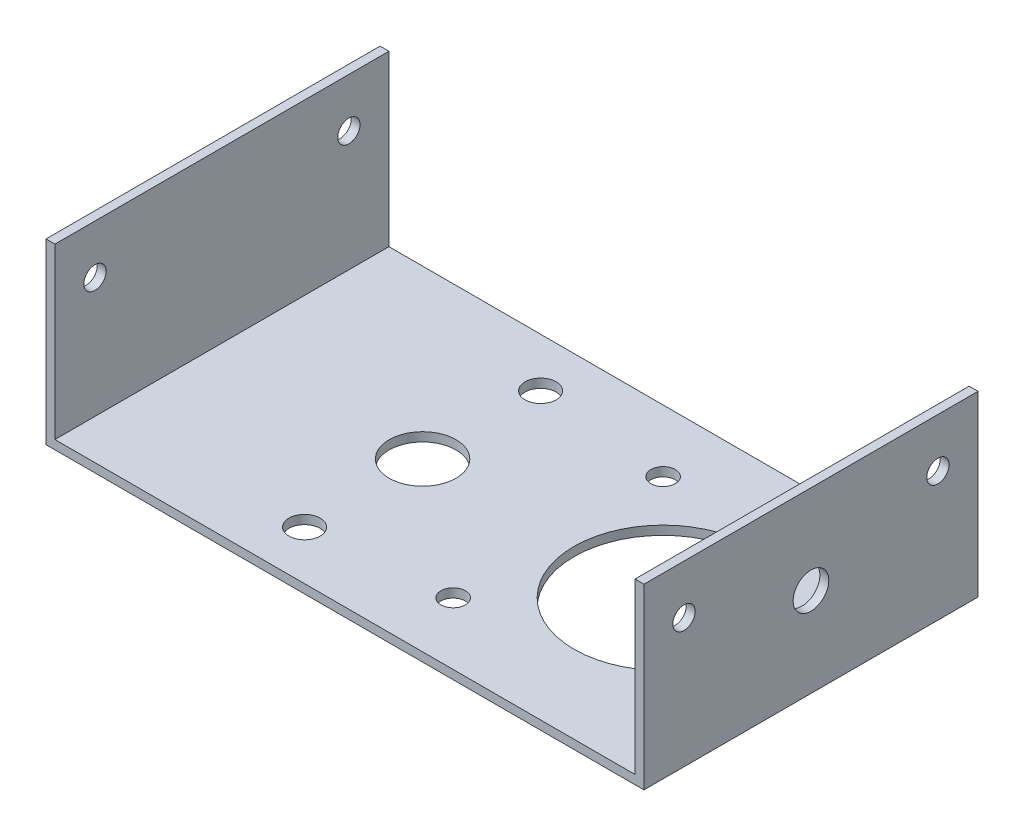
ISO-10303-21;
HEADER;
FILE_DESCRIPTION(('STEP AP214'),'2;1');
FILE_NAME('part.step','',(''),(''),'','','');
FILE_SCHEMA(('AUTOMOTIVE_DESIGN { 1 0 10303 214 1 1 1 1 }'));
ENDSEC;
DATA;
#1=APPLICATION_CONTEXT('core data for automotive mechanical design processes');
#2=APPLICATION_PROTOCOL_DEFINITION('international standard','automotive_design',2000,#1);
#3=PRODUCT_CONTEXT('',#1,'mechanical');
#4=PRODUCT('Part','Part','',(#3));
#5=PRODUCT_RELATED_PRODUCT_CATEGORY('part','',(#4));
#6=PRODUCT_DEFINITION_FORMATION('','',#4);
#7=PRODUCT_DEFINITION_CONTEXT('part definition',#1,'design');
#8=PRODUCT_DEFINITION('design','',#6,#7);
#9=PRODUCT_DEFINITION_SHAPE('','',#8);
#10=(LENGTH_UNIT() NAMED_UNIT(*) SI_UNIT(.MILLI.,.METRE.));
#11=(NAMED_UNIT(*) PLANE_ANGLE_UNIT() SI_UNIT($,.RADIAN.));
#12=(NAMED_UNIT(*) SI_UNIT($,.STERADIAN.) SOLID_ANGLE_UNIT());
#13=UNCERTAINTY_MEASURE_WITH_UNIT(LENGTH_MEASURE(1.E-05),#10,'distance_accuracy_value','');
#14=(GEOMETRIC_REPRESENTATION_CONTEXT(3) GLOBAL_UNCERTAINTY_ASSIGNED_CONTEXT((#13)) GLOBAL_UNIT_ASSIGNED_CONTEXT((#10,
#11,#12)) REPRESENTATION_CONTEXT('',''));
#15=CARTESIAN_POINT('',(0.,0.,0.));
#16=DIRECTION('',(0.,0.,1.));
#17=DIRECTION('',(1.,0.,0.));
#18=AXIS2_PLACEMENT_3D('',#15,#16,#17);
#19=CARTESIAN_POINT('',(-33.2,40.,-37.5));
#20=DIRECTION('',(0.,1.,0.));
#21=DIRECTION('',(0.,0.,1.));
#22=AXIS2_PLACEMENT_3D('',#19,#20,#21);
#23=PLANE('',#22);
#24=DIRECTION('',(1.,0.,0.));
#25=VECTOR('',#24,1.);
#26=CARTESIAN_POINT('',(-33.2,40.,37.5));
#27=LINE('',#26,#25);
#28=CARTESIAN_POINT('',(-101.05,40.,37.5));
#29=VERTEX_POINT('',#28);
#30=CARTESIAN_POINT('',(-99.05,40.,37.5));
#31=VERTEX_POINT('',#30);
#32=EDGE_CURVE('E212',#29,#31,#27,.T.);
#33=ORIENTED_EDGE('',*,*,#32,.T.);
#34=DIRECTION('',(0.,0.,1.));
#35=VECTOR('',#34,1.);
#36=CARTESIAN_POINT('',(-99.05,40.,-37.5));
#37=LINE('',#36,#35);
#38=CARTESIAN_POINT('',(-99.05,40.,-37.5));
#39=VERTEX_POINT('',#38);
#40=EDGE_CURVE('E125',#39,#31,#37,.T.);
#41=ORIENTED_EDGE('',*,*,#40,.F.);
#42=DIRECTION('',(1.,0.,0.));
#43=VECTOR('',#42,1.);
#44=CARTESIAN_POINT('',(-33.2,40.,-37.5));
#45=LINE('',#44,#43);
#46=CARTESIAN_POINT('',(-101.05,40.,-37.5));
#47=VERTEX_POINT('',#46);
#48=EDGE_CURVE('E208',#47,#39,#45,.T.);
#49=ORIENTED_EDGE('',*,*,#48,.F.);
#50=DIRECTION('',(0.,0.,-1.));
#51=VECTOR('',#50,1.);
#52=CARTESIAN_POINT('',(-101.05,40.,37.5));
#53=LINE('',#52,#51);
#54=EDGE_CURVE('E139',#29,#47,#53,.T.);
#55=ORIENTED_EDGE('',*,*,#54,.F.);
#56=EDGE_LOOP('',(#33,#41,#49,#55));
#57=FACE_BOUND('',#56,.T.);
#58=ADVANCED_FACE('F40',(#57),#23,.T.);
#59=CARTESIAN_POINT('',(-31.2,2.,-37.5));
#60=DIRECTION('',(0.,0.,1.));
#61=DIRECTION('',(1.,0.,0.));
#62=AXIS2_PLACEMENT_3D('',#59,#60,#61);
#63=PLANE('',#62);
#64=DIRECTION('',(0.,1.,0.));
#65=VECTOR('',#64,1.);
#66=CARTESIAN_POINT('',(-99.05,2.,-37.5));
#67=LINE('',#66,#65);
#68=CARTESIAN_POINT('',(-99.05,2.,-37.5));
#69=VERTEX_POINT('',#68);
#70=EDGE_CURVE('E121',#69,#39,#67,.T.);
#71=ORIENTED_EDGE('',*,*,#70,.F.);
#72=DIRECTION('',(-1.,0.,0.));
#73=VECTOR('',#72,1.);
#74=CARTESIAN_POINT('',(-31.2,2.,-37.5));
#75=LINE('',#74,#73);
#76=CARTESIAN_POINT('',(31.2,2.,-37.5));
#77=VERTEX_POINT('',#76);
#78=EDGE_CURVE('E50',#77,#69,#75,.T.);
#79=ORIENTED_EDGE('',*,*,#78,.F.);
#80=DIRECTION('',(0.,1.,0.));
#81=VECTOR('',#80,1.);
#82=CARTESIAN_POINT('',(31.2,0.,-37.5));
#83=LINE('',#82,#81);
#84=CARTESIAN_POINT('',(31.2,40.,-37.5));
#85=VERTEX_POINT('',#84);
#86=EDGE_CURVE('E58',#77,#85,#83,.T.);
#87=ORIENTED_EDGE('',*,*,#86,.T.);
#88=DIRECTION('',(-1.,0.,0.));
#89=VECTOR('',#88,1.);
#90=CARTESIAN_POINT('',(33.2,40.,-37.5));
#91=LINE('',#90,#89);
#92=CARTESIAN_POINT('',(33.2,40.,-37.5));
#93=VERTEX_POINT('',#92);
#94=EDGE_CURVE('E240',#93,#85,#91,.T.);
#95=ORIENTED_EDGE('',*,*,#94,.F.);
#96=DIRECTION('',(0.,1.,0.));
#97=VECTOR('',#96,1.);
#98=CARTESIAN_POINT('',(33.2,0.,-37.5));
#99=LINE('',#98,#97);
#100=CARTESIAN_POINT('',(33.2,0.,-37.5));
#101=VERTEX_POINT('',#100);
#102=EDGE_CURVE('E215',#101,#93,#99,.T.);
#103=ORIENTED_EDGE('',*,*,#102,.F.);
#104=DIRECTION('',(-1.,0.,0.));
#105=VECTOR('',#104,1.);
#106=CARTESIAN_POINT('',(-31.2,0.,-37.5));
#107=LINE('',#106,#105);
#108=CARTESIAN_POINT('',(-101.05,0.,-37.5));
#109=VERTEX_POINT('',#108);
#110=EDGE_CURVE('E244',#101,#109,#107,.T.);
#111=ORIENTED_EDGE('',*,*,#110,.T.);
#112=DIRECTION('',(0.,-1.,0.));
#113=VECTOR('',#112,1.);
#114=CARTESIAN_POINT('',(-101.05,40.,-37.5));
#115=LINE('',#114,#113);
#116=EDGE_CURVE('E143',#47,#109,#115,.T.);
#117=ORIENTED_EDGE('',*,*,#116,.F.);
#118=ORIENTED_EDGE('',*,*,#48,.T.);
#119=EDGE_LOOP('',(#71,#79,#87,#95,#103,#111,#117,#118));
#120=FACE_BOUND('',#119,.T.);
#121=ADVANCED_FACE('F42',(#120),#63,.F.);
#122=CARTESIAN_POINT('',(-31.2,2.,37.5));
#123=DIRECTION('',(0.,0.,-1.));
#124=DIRECTION('',(-1.,0.,0.));
#125=AXIS2_PLACEMENT_3D('',#122,#123,#124);
#126=PLANE('',#125);
#127=DIRECTION('',(1.,0.,0.));
#128=VECTOR('',#127,1.);
#129=CARTESIAN_POINT('',(-31.2,2.,37.5));
#130=LINE('',#129,#128);
#131=CARTESIAN_POINT('',(-99.05,2.,37.5));
#132=VERTEX_POINT('',#131);
#133=CARTESIAN_POINT('',(31.2,2.,37.5));
#134=VERTEX_POINT('',#133);
#135=EDGE_CURVE('E11',#132,#134,#130,.T.);
#136=ORIENTED_EDGE('',*,*,#135,.F.);
#137=DIRECTION('',(0.,-1.,0.));
#138=VECTOR('',#137,1.);
#139=CARTESIAN_POINT('',(-99.05,40.,37.5));
#140=LINE('',#139,#138);
#141=EDGE_CURVE('E110',#31,#132,#140,.T.);
#142=ORIENTED_EDGE('',*,*,#141,.F.);
#143=ORIENTED_EDGE('',*,*,#32,.F.);
#144=DIRECTION('',(0.,1.,0.));
#145=VECTOR('',#144,1.);
#146=CARTESIAN_POINT('',(-101.05,0.,37.5));
#147=LINE('',#146,#145);
#148=CARTESIAN_POINT('',(-101.05,0.,37.5));
#149=VERTEX_POINT('',#148);
#150=EDGE_CURVE('E151',#149,#29,#147,.T.);
#151=ORIENTED_EDGE('',*,*,#150,.F.);
#152=DIRECTION('',(1.,0.,0.));
#153=VECTOR('',#152,1.);
#154=CARTESIAN_POINT('',(-31.2,0.,37.5));
#155=LINE('',#154,#153);
#156=CARTESIAN_POINT('',(33.2,0.,37.5));
#157=VERTEX_POINT('',#156);
#158=EDGE_CURVE('E247',#149,#157,#155,.T.);
#159=ORIENTED_EDGE('',*,*,#158,.T.);
#160=DIRECTION('',(0.,-1.,0.));
#161=VECTOR('',#160,1.);
#162=CARTESIAN_POINT('',(33.2,0.,37.5));
#163=LINE('',#162,#161);
#164=CARTESIAN_POINT('',(33.2,40.,37.5));
#165=VERTEX_POINT('',#164);
#166=EDGE_CURVE('E222',#165,#157,#163,.T.);
#167=ORIENTED_EDGE('',*,*,#166,.F.);
#168=DIRECTION('',(-1.,0.,0.));
#169=VECTOR('',#168,1.);
#170=CARTESIAN_POINT('',(33.2,40.,37.5));
#171=LINE('',#170,#169);
#172=CARTESIAN_POINT('',(31.2,40.,37.5));
#173=VERTEX_POINT('',#172);
#174=EDGE_CURVE('E230',#165,#173,#171,.T.);
#175=ORIENTED_EDGE('',*,*,#174,.T.);
#176=DIRECTION('',(0.,-1.,0.));
#177=VECTOR('',#176,1.);
#178=CARTESIAN_POINT('',(31.2,0.,37.5));
#179=LINE('',#178,#177);
#180=EDGE_CURVE('E113',#173,#134,#179,.T.);
#181=ORIENTED_EDGE('',*,*,#180,.T.);
#182=EDGE_LOOP('',(#136,#142,#143,#151,#159,#167,#175,#181));
#183=FACE_BOUND('',#182,.T.);
#184=ADVANCED_FACE('F108',(#183),#126,.F.);
#185=CARTESIAN_POINT('',(0.,2.,0.));
#186=DIRECTION('',(0.,-1.,0.));
#187=DIRECTION('',(0.,0.,-1.));
#188=AXIS2_PLACEMENT_3D('',#185,#186,#187);
#189=PLANE('',#188);
#190=CARTESIAN_POINT('',(-54.,2.,-26.5));
#191=DIRECTION('',(0.,1.,0.));
#192=DIRECTION('',(0.,0.,1.));
#193=AXIS2_PLACEMENT_3D('',#190,#191,#192);
#194=CIRCLE('',#193,3.5);
#195=CARTESIAN_POINT('',(-54.,2.,-23.));
#196=VERTEX_POINT('',#195);
#197=EDGE_CURVE('E265',#196,#196,#194,.T.);
#198=ORIENTED_EDGE('',*,*,#197,.F.);
#199=EDGE_LOOP('',(#198));
#200=FACE_BOUND('',#199,.T.);
#201=CARTESIAN_POINT('',(-54.,2.,26.5));
#202=DIRECTION('',(0.,1.,0.));
#203=DIRECTION('',(0.,0.,1.));
#204=AXIS2_PLACEMENT_3D('',#201,#202,#203);
#205=CIRCLE('',#204,3.5);
#206=CARTESIAN_POINT('',(-54.,2.,30.));
#207=VERTEX_POINT('',#206);
#208=EDGE_CURVE('E272',#207,#207,#205,.T.);
#209=ORIENTED_EDGE('',*,*,#208,.F.);
#210=EDGE_LOOP('',(#209));
#211=FACE_BOUND('',#210,.T.);
#212=CARTESIAN_POINT('',(-54.,2.,0.));
#213=DIRECTION('',(0.,1.,0.));
#214=DIRECTION('',(0.,0.,1.));
#215=AXIS2_PLACEMENT_3D('',#212,#213,#214);
#216=CIRCLE('',#215,7.5);
#217=CARTESIAN_POINT('',(-54.,2.,7.49999999999999));
#218=VERTEX_POINT('',#217);
#219=EDGE_CURVE('E261',#218,#218,#216,.T.);
#220=ORIENTED_EDGE('',*,*,#219,.F.);
#221=EDGE_LOOP('',(#220));
#222=FACE_BOUND('',#221,.T.);
#223=CARTESIAN_POINT('',(-23.57,2.,-23.5699999999996));
#224=DIRECTION('',(0.,1.,0.));
#225=DIRECTION('',(0.,0.,1.));
#226=AXIS2_PLACEMENT_3D('',#223,#224,#225);
#227=CIRCLE('',#226,2.75);
#228=CARTESIAN_POINT('',(-23.57,2.,-20.8199999999996));
#229=VERTEX_POINT('',#228);
#230=EDGE_CURVE('E155',#229,#229,#227,.T.);
#231=ORIENTED_EDGE('',*,*,#230,.F.);
#232=EDGE_LOOP('',(#231));
#233=FACE_BOUND('',#232,.T.);
#234=CARTESIAN_POINT('',(-23.57,2.,23.5700000000004));
#235=DIRECTION('',(0.,1.,0.));
#236=DIRECTION('',(0.,0.,1.));
#237=AXIS2_PLACEMENT_3D('',#234,#235,#236);
#238=CIRCLE('',#237,2.75);
#239=CARTESIAN_POINT('',(-23.57,2.,26.3200000000004));
#240=VERTEX_POINT('',#239);
#241=EDGE_CURVE('E169',#240,#240,#238,.T.);
#242=ORIENTED_EDGE('',*,*,#241,.F.);
#243=EDGE_LOOP('',(#242));
#244=FACE_BOUND('',#243,.T.);
#245=CARTESIAN_POINT('',(23.57,2.,23.5700000000005));
#246=DIRECTION('',(0.,1.,0.));
#247=DIRECTION('',(0.,0.,1.));
#248=AXIS2_PLACEMENT_3D('',#245,#246,#247);
#249=CIRCLE('',#248,2.75000000000001);
#250=CARTESIAN_POINT('',(23.57,2.,26.3200000000005));
#251=VERTEX_POINT('',#250);
#252=EDGE_CURVE('E161',#251,#251,#249,.T.);
#253=ORIENTED_EDGE('',*,*,#252,.F.);
#254=EDGE_LOOP('',(#253));
#255=FACE_BOUND('',#254,.T.);
#256=CARTESIAN_POINT('',(23.57,2.,-23.5699999999996));
#257=DIRECTION('',(0.,1.,0.));
#258=DIRECTION('',(0.,0.,1.));
#259=AXIS2_PLACEMENT_3D('',#256,#257,#258);
#260=CIRCLE('',#259,2.75000000000001);
#261=CARTESIAN_POINT('',(23.57,2.,-20.8199999999996));
#262=VERTEX_POINT('',#261);
#263=EDGE_CURVE('E160',#262,#262,#260,.T.);
#264=ORIENTED_EDGE('',*,*,#263,.F.);
#265=EDGE_LOOP('',(#264));
#266=FACE_BOUND('',#265,.T.);
#267=CARTESIAN_POINT('',(0.,2.,0.));
#268=DIRECTION('',(0.,1.,0.));
#269=DIRECTION('',(0.,0.,1.));
#270=AXIS2_PLACEMENT_3D('',#267,#268,#269);
#271=CIRCLE('',#270,20.);
#272=CARTESIAN_POINT('',(0.,2.,20.));
#273=VERTEX_POINT('',#272);
#274=EDGE_CURVE('E184',#273,#273,#271,.T.);
#275=ORIENTED_EDGE('',*,*,#274,.F.);
#276=EDGE_LOOP('',(#275));
#277=FACE_BOUND('',#276,.T.);
#278=DIRECTION('',(0.,0.,-1.));
#279=VECTOR('',#278,1.);
#280=CARTESIAN_POINT('',(31.2,2.,37.5));
#281=LINE('',#280,#279);
#282=EDGE_CURVE('E63',#134,#77,#281,.T.);
#283=ORIENTED_EDGE('',*,*,#282,.T.);
#284=ORIENTED_EDGE('',*,*,#78,.T.);
#285=DIRECTION('',(0.,0.,-1.));
#286=VECTOR('',#285,1.);
#287=CARTESIAN_POINT('',(-99.05,2.,37.5));
#288=LINE('',#287,#286);
#289=EDGE_CURVE('E116',#132,#69,#288,.T.);
#290=ORIENTED_EDGE('',*,*,#289,.F.);
#291=ORIENTED_EDGE('',*,*,#135,.T.);
#292=EDGE_LOOP('',(#283,#284,#290,#291));
#293=FACE_BOUND('',#292,.T.);
#294=ADVANCED_FACE('F117',(#200,#211,#222,#233,#244,#255,#266,#277,#293),#189,.F.);
#295=CARTESIAN_POINT('',(0.,0.,0.));
#296=DIRECTION('',(0.,-1.,0.));
#297=DIRECTION('',(0.,0.,-1.));
#298=AXIS2_PLACEMENT_3D('',#295,#296,#297);
#299=PLANE('',#298);
#300=CARTESIAN_POINT('',(-54.,0.,-26.5));
#301=DIRECTION('',(0.,-1.,0.));
#302=DIRECTION('',(0.,0.,-1.));
#303=AXIS2_PLACEMENT_3D('',#300,#301,#302);
#304=CIRCLE('',#303,3.5);
#305=CARTESIAN_POINT('',(-54.,0.,-30.));
#306=VERTEX_POINT('',#305);
#307=EDGE_CURVE('E44',#306,#306,#304,.T.);
#308=ORIENTED_EDGE('',*,*,#307,.F.);
#309=EDGE_LOOP('',(#308));
#310=FACE_BOUND('',#309,.T.);
#311=CARTESIAN_POINT('',(-54.,0.,26.5));
#312=DIRECTION('',(0.,-1.,0.));
#313=DIRECTION('',(0.,0.,-1.));
#314=AXIS2_PLACEMENT_3D('',#311,#312,#313);
#315=CIRCLE('',#314,3.5);
#316=CARTESIAN_POINT('',(-54.,0.,23.));
#317=VERTEX_POINT('',#316);
#318=EDGE_CURVE('E262',#317,#317,#315,.T.);
#319=ORIENTED_EDGE('',*,*,#318,.F.);
#320=EDGE_LOOP('',(#319));
#321=FACE_BOUND('',#320,.T.);
#322=CARTESIAN_POINT('',(-54.,0.,0.));
#323=DIRECTION('',(0.,-1.,0.));
#324=DIRECTION('',(0.,0.,-1.));
#325=AXIS2_PLACEMENT_3D('',#322,#323,#324);
#326=CIRCLE('',#325,7.5);
#327=CARTESIAN_POINT('',(-54.,0.,-7.50000000000001));
#328=VERTEX_POINT('',#327);
#329=EDGE_CURVE('E257',#328,#328,#326,.T.);
#330=ORIENTED_EDGE('',*,*,#329,.F.);
#331=EDGE_LOOP('',(#330));
#332=FACE_BOUND('',#331,.T.);
#333=CARTESIAN_POINT('',(-23.57,0.,-23.5699999999996));
#334=DIRECTION('',(0.,1.,0.));
#335=DIRECTION('',(0.,0.,1.));
#336=AXIS2_PLACEMENT_3D('',#333,#334,#335);
#337=CIRCLE('',#336,2.75);
#338=CARTESIAN_POINT('',(-23.57,0.,-20.8199999999996));
#339=VERTEX_POINT('',#338);
#340=EDGE_CURVE('E173',#339,#339,#337,.T.);
#341=ORIENTED_EDGE('',*,*,#340,.T.);
#342=EDGE_LOOP('',(#341));
#343=FACE_BOUND('',#342,.T.);
#344=CARTESIAN_POINT('',(-23.57,0.,23.5700000000004));
#345=DIRECTION('',(0.,1.,0.));
#346=DIRECTION('',(0.,0.,1.));
#347=AXIS2_PLACEMENT_3D('',#344,#345,#346);
#348=CIRCLE('',#347,2.75);
#349=CARTESIAN_POINT('',(-23.57,0.,26.3200000000004));
#350=VERTEX_POINT('',#349);
#351=EDGE_CURVE('E165',#350,#350,#348,.T.);
#352=ORIENTED_EDGE('',*,*,#351,.T.);
#353=EDGE_LOOP('',(#352));
#354=FACE_BOUND('',#353,.T.);
#355=CARTESIAN_POINT('',(23.57,0.,23.5700000000005));
#356=DIRECTION('',(0.,1.,0.));
#357=DIRECTION('',(0.,0.,1.));
#358=AXIS2_PLACEMENT_3D('',#355,#356,#357);
#359=CIRCLE('',#358,2.75000000000001);
#360=CARTESIAN_POINT('',(23.57,0.,26.3200000000005));
#361=VERTEX_POINT('',#360);
#362=EDGE_CURVE('E156',#361,#361,#359,.T.);
#363=ORIENTED_EDGE('',*,*,#362,.T.);
#364=EDGE_LOOP('',(#363));
#365=FACE_BOUND('',#364,.T.);
#366=CARTESIAN_POINT('',(23.57,0.,-23.5699999999996));
#367=DIRECTION('',(0.,1.,0.));
#368=DIRECTION('',(0.,0.,1.));
#369=AXIS2_PLACEMENT_3D('',#366,#367,#368);
#370=CIRCLE('',#369,2.75000000000001);
#371=CARTESIAN_POINT('',(23.57,0.,-20.8199999999996));
#372=VERTEX_POINT('',#371);
#373=EDGE_CURVE('E180',#372,#372,#370,.T.);
#374=ORIENTED_EDGE('',*,*,#373,.T.);
#375=EDGE_LOOP('',(#374));
#376=FACE_BOUND('',#375,.T.);
#377=CARTESIAN_POINT('',(0.,0.,0.));
#378=DIRECTION('',(0.,-1.,0.));
#379=DIRECTION('',(0.,0.,-1.));
#380=AXIS2_PLACEMENT_3D('',#377,#378,#379);
#381=CIRCLE('',#380,20.);
#382=CARTESIAN_POINT('',(0.,0.,-20.));
#383=VERTEX_POINT('',#382);
#384=EDGE_CURVE('E191',#383,#383,#381,.T.);
#385=ORIENTED_EDGE('',*,*,#384,.F.);
#386=EDGE_LOOP('',(#385));
#387=FACE_BOUND('',#386,.T.);
#388=ORIENTED_EDGE('',*,*,#110,.F.);
#389=DIRECTION('',(0.,0.,-1.));
#390=VECTOR('',#389,1.);
#391=CARTESIAN_POINT('',(33.2,0.,-37.5));
#392=LINE('',#391,#390);
#393=EDGE_CURVE('E226',#157,#101,#392,.T.);
#394=ORIENTED_EDGE('',*,*,#393,.F.);
#395=ORIENTED_EDGE('',*,*,#158,.F.);
#396=DIRECTION('',(0.,0.,1.));
#397=VECTOR('',#396,1.);
#398=CARTESIAN_POINT('',(-101.05,0.,-37.5));
#399=LINE('',#398,#397);
#400=EDGE_CURVE('E147',#109,#149,#399,.T.);
#401=ORIENTED_EDGE('',*,*,#400,.F.);
#402=EDGE_LOOP('',(#388,#394,#395,#401));
#403=FACE_BOUND('',#402,.T.);
#404=ADVANCED_FACE('F315',(#310,#321,#332,#343,#354,#365,#376,#387,#403),#299,.T.);
#405=CARTESIAN_POINT('',(33.2,40.,-37.5));
#406=DIRECTION('',(0.,-1.,0.));
#407=DIRECTION('',(0.,0.,-1.));
#408=AXIS2_PLACEMENT_3D('',#405,#406,#407);
#409=PLANE('',#408);
#410=DIRECTION('',(0.,0.,1.));
#411=VECTOR('',#410,1.);
#412=CARTESIAN_POINT('',(31.2,40.,-37.5));
#413=LINE('',#412,#411);
#414=EDGE_CURVE('E233',#85,#173,#413,.T.);
#415=ORIENTED_EDGE('',*,*,#414,.T.);
#416=ORIENTED_EDGE('',*,*,#174,.F.);
#417=DIRECTION('',(0.,0.,1.));
#418=VECTOR('',#417,1.);
#419=CARTESIAN_POINT('',(33.2,40.,-37.5));
#420=LINE('',#419,#418);
#421=EDGE_CURVE('E219',#93,#165,#420,.T.);
#422=ORIENTED_EDGE('',*,*,#421,.F.);
#423=ORIENTED_EDGE('',*,*,#94,.T.);
#424=EDGE_LOOP('',(#415,#416,#422,#423));
#425=FACE_BOUND('',#424,.T.);
#426=ADVANCED_FACE('F322',(#425),#409,.F.);
#427=CARTESIAN_POINT('',(33.2,0.,0.));
#428=DIRECTION('',(1.,0.,0.));
#429=DIRECTION('',(0.,0.,-1.));
#430=AXIS2_PLACEMENT_3D('',#427,#428,#429);
#431=PLANE('',#430);
#432=CARTESIAN_POINT('',(33.2,20.,0.));
#433=DIRECTION('',(1.,0.,0.));
#434=DIRECTION('',(0.,0.,-1.));
#435=AXIS2_PLACEMENT_3D('',#432,#433,#434);
#436=CIRCLE('',#435,4.);
#437=CARTESIAN_POINT('',(33.2,20.,-4.));
#438=VERTEX_POINT('',#437);
#439=EDGE_CURVE('E278',#438,#438,#436,.T.);
#440=ORIENTED_EDGE('',*,*,#439,.F.);
#441=EDGE_LOOP('',(#440));
#442=FACE_BOUND('',#441,.T.);
#443=CARTESIAN_POINT('',(33.2,29.,-28.5));
#444=DIRECTION('',(-1.,0.,0.));
#445=DIRECTION('',(0.,0.,1.));
#446=AXIS2_PLACEMENT_3D('',#443,#444,#445);
#447=CIRCLE('',#446,2.5);
#448=CARTESIAN_POINT('',(33.2,29.,-26.));
#449=VERTEX_POINT('',#448);
#450=EDGE_CURVE('E192',#449,#449,#447,.T.);
#451=ORIENTED_EDGE('',*,*,#450,.T.);
#452=EDGE_LOOP('',(#451));
#453=FACE_BOUND('',#452,.T.);
#454=CARTESIAN_POINT('',(33.2,29.,28.5));
#455=DIRECTION('',(-1.,0.,0.));
#456=DIRECTION('',(0.,0.,-1.));
#457=AXIS2_PLACEMENT_3D('',#454,#455,#456);
#458=CIRCLE('',#457,2.5);
#459=CARTESIAN_POINT('',(33.2,29.,26.));
#460=VERTEX_POINT('',#459);
#461=EDGE_CURVE('E197',#460,#460,#458,.T.);
#462=ORIENTED_EDGE('',*,*,#461,.T.);
#463=EDGE_LOOP('',(#462));
#464=FACE_BOUND('',#463,.T.);
#465=ORIENTED_EDGE('',*,*,#102,.T.);
#466=ORIENTED_EDGE('',*,*,#421,.T.);
#467=ORIENTED_EDGE('',*,*,#166,.T.);
#468=ORIENTED_EDGE('',*,*,#393,.T.);
#469=EDGE_LOOP('',(#465,#466,#467,#468));
#470=FACE_BOUND('',#469,.T.);
#471=ADVANCED_FACE('F317',(#442,#453,#464,#470),#431,.T.);
#472=CARTESIAN_POINT('',(31.2,0.,0.));
#473=DIRECTION('',(1.,0.,0.));
#474=DIRECTION('',(0.,0.,-1.));
#475=AXIS2_PLACEMENT_3D('',#472,#473,#474);
#476=PLANE('',#475);
#477=CARTESIAN_POINT('',(31.2,20.,0.));
#478=DIRECTION('',(-1.,0.,0.));
#479=DIRECTION('',(0.,0.,1.));
#480=AXIS2_PLACEMENT_3D('',#477,#478,#479);
#481=CIRCLE('',#480,4.);
#482=CARTESIAN_POINT('',(31.2,20.,4.));
#483=VERTEX_POINT('',#482);
#484=EDGE_CURVE('E355',#483,#483,#481,.T.);
#485=ORIENTED_EDGE('',*,*,#484,.F.);
#486=EDGE_LOOP('',(#485));
#487=FACE_BOUND('',#486,.T.);
#488=CARTESIAN_POINT('',(31.2,29.,-28.5));
#489=DIRECTION('',(1.,0.,0.));
#490=DIRECTION('',(0.,0.,-1.));
#491=AXIS2_PLACEMENT_3D('',#488,#489,#490);
#492=CIRCLE('',#491,2.5);
#493=CARTESIAN_POINT('',(31.2,29.,-31.));
#494=VERTEX_POINT('',#493);
#495=EDGE_CURVE('E204',#494,#494,#492,.T.);
#496=ORIENTED_EDGE('',*,*,#495,.T.);
#497=EDGE_LOOP('',(#496));
#498=FACE_BOUND('',#497,.T.);
#499=CARTESIAN_POINT('',(31.2,29.,28.5));
#500=DIRECTION('',(1.,0.,0.));
#501=DIRECTION('',(0.,0.,-1.));
#502=AXIS2_PLACEMENT_3D('',#499,#500,#501);
#503=CIRCLE('',#502,2.5);
#504=CARTESIAN_POINT('',(31.2,29.,26.));
#505=VERTEX_POINT('',#504);
#506=EDGE_CURVE('E196',#505,#505,#503,.T.);
#507=ORIENTED_EDGE('',*,*,#506,.T.);
#508=EDGE_LOOP('',(#507));
#509=FACE_BOUND('',#508,.T.);
#510=ORIENTED_EDGE('',*,*,#282,.F.);
#511=ORIENTED_EDGE('',*,*,#180,.F.);
#512=ORIENTED_EDGE('',*,*,#414,.F.);
#513=ORIENTED_EDGE('',*,*,#86,.F.);
#514=EDGE_LOOP('',(#510,#511,#512,#513));
#515=FACE_BOUND('',#514,.T.);
#516=ADVANCED_FACE('F321',(#487,#498,#509,#515),#476,.F.);
#517=CARTESIAN_POINT('',(33.2,29.,28.5));
#518=DIRECTION('',(-1.,0.,0.));
#519=DIRECTION('',(0.,0.,1.));
#520=AXIS2_PLACEMENT_3D('',#517,#518,#519);
#521=CYLINDRICAL_SURFACE('',#520,2.5);
#522=ORIENTED_EDGE('',*,*,#461,.F.);
#523=EDGE_LOOP('',(#522));
#524=FACE_BOUND('',#523,.T.);
#525=ORIENTED_EDGE('',*,*,#506,.F.);
#526=EDGE_LOOP('',(#525));
#527=FACE_BOUND('',#526,.T.);
#528=ADVANCED_FACE('F342',(#524,#527),#521,.F.);
#529=CARTESIAN_POINT('',(33.2,29.,-28.5));
#530=DIRECTION('',(-1.,0.,0.));
#531=DIRECTION('',(0.,0.,1.));
#532=AXIS2_PLACEMENT_3D('',#529,#530,#531);
#533=CYLINDRICAL_SURFACE('',#532,2.5);
#534=ORIENTED_EDGE('',*,*,#450,.F.);
#535=EDGE_LOOP('',(#534));
#536=FACE_BOUND('',#535,.T.);
#537=ORIENTED_EDGE('',*,*,#495,.F.);
#538=EDGE_LOOP('',(#537));
#539=FACE_BOUND('',#538,.T.);
#540=ADVANCED_FACE('F350',(#536,#539),#533,.F.);
#541=CARTESIAN_POINT('',(0.,-3.,0.));
#542=DIRECTION('',(0.,1.,0.));
#543=DIRECTION('',(0.,0.,1.));
#544=AXIS2_PLACEMENT_3D('',#541,#542,#543);
#545=CYLINDRICAL_SURFACE('',#544,20.);
#546=ORIENTED_EDGE('',*,*,#384,.T.);
#547=EDGE_LOOP('',(#546));
#548=FACE_BOUND('',#547,.T.);
#549=ORIENTED_EDGE('',*,*,#274,.T.);
#550=EDGE_LOOP('',(#549));
#551=FACE_BOUND('',#550,.T.);
#552=ADVANCED_FACE('F362',(#548,#551),#545,.F.);
#553=CARTESIAN_POINT('',(23.57,0.,-23.5699999999996));
#554=DIRECTION('',(0.,1.,0.));
#555=DIRECTION('',(0.,0.,1.));
#556=AXIS2_PLACEMENT_3D('',#553,#554,#555);
#557=CYLINDRICAL_SURFACE('',#556,2.75000000000001);
#558=ORIENTED_EDGE('',*,*,#373,.F.);
#559=EDGE_LOOP('',(#558));
#560=FACE_BOUND('',#559,.T.);
#561=ORIENTED_EDGE('',*,*,#263,.T.);
#562=EDGE_LOOP('',(#561));
#563=FACE_BOUND('',#562,.T.);
#564=ADVANCED_FACE('F367',(#560,#563),#557,.F.);
#565=CARTESIAN_POINT('',(23.57,0.,23.5700000000005));
#566=DIRECTION('',(0.,1.,0.));
#567=DIRECTION('',(0.,0.,1.));
#568=AXIS2_PLACEMENT_3D('',#565,#566,#567);
#569=CYLINDRICAL_SURFACE('',#568,2.75000000000001);
#570=ORIENTED_EDGE('',*,*,#362,.F.);
#571=EDGE_LOOP('',(#570));
#572=FACE_BOUND('',#571,.T.);
#573=ORIENTED_EDGE('',*,*,#252,.T.);
#574=EDGE_LOOP('',(#573));
#575=FACE_BOUND('',#574,.T.);
#576=ADVANCED_FACE('F374',(#572,#575),#569,.F.);
#577=CARTESIAN_POINT('',(-23.57,0.,23.5700000000004));
#578=DIRECTION('',(0.,1.,0.));
#579=DIRECTION('',(0.,0.,1.));
#580=AXIS2_PLACEMENT_3D('',#577,#578,#579);
#581=CYLINDRICAL_SURFACE('',#580,2.75);
#582=ORIENTED_EDGE('',*,*,#351,.F.);
#583=EDGE_LOOP('',(#582));
#584=FACE_BOUND('',#583,.T.);
#585=ORIENTED_EDGE('',*,*,#241,.T.);
#586=EDGE_LOOP('',(#585));
#587=FACE_BOUND('',#586,.T.);
#588=ADVANCED_FACE('F378',(#584,#587),#581,.F.);
#589=CARTESIAN_POINT('',(-23.57,0.,-23.5699999999996));
#590=DIRECTION('',(0.,1.,0.));
#591=DIRECTION('',(0.,0.,1.));
#592=AXIS2_PLACEMENT_3D('',#589,#590,#591);
#593=CYLINDRICAL_SURFACE('',#592,2.75);
#594=ORIENTED_EDGE('',*,*,#340,.F.);
#595=EDGE_LOOP('',(#594));
#596=FACE_BOUND('',#595,.T.);
#597=ORIENTED_EDGE('',*,*,#230,.T.);
#598=EDGE_LOOP('',(#597));
#599=FACE_BOUND('',#598,.T.);
#600=ADVANCED_FACE('F302',(#596,#599),#593,.F.);
#601=CARTESIAN_POINT('',(-101.05,0.,0.));
#602=DIRECTION('',(-1.,0.,0.));
#603=DIRECTION('',(0.,0.,1.));
#604=AXIS2_PLACEMENT_3D('',#601,#602,#603);
#605=PLANE('',#604);
#606=CARTESIAN_POINT('',(-101.05,29.,-28.5));
#607=DIRECTION('',(-1.,0.,0.));
#608=DIRECTION('',(0.,0.,1.));
#609=AXIS2_PLACEMENT_3D('',#606,#607,#608);
#610=CIRCLE('',#609,2.5);
#611=CARTESIAN_POINT('',(-101.05,29.,-26.));
#612=VERTEX_POINT('',#611);
#613=EDGE_CURVE('E127',#612,#612,#610,.T.);
#614=ORIENTED_EDGE('',*,*,#613,.F.);
#615=EDGE_LOOP('',(#614));
#616=FACE_BOUND('',#615,.T.);
#617=CARTESIAN_POINT('',(-101.05,29.,28.5));
#618=DIRECTION('',(-1.,0.,0.));
#619=DIRECTION('',(0.,0.,1.));
#620=AXIS2_PLACEMENT_3D('',#617,#618,#619);
#621=CIRCLE('',#620,2.5);
#622=CARTESIAN_POINT('',(-101.05,29.,31.));
#623=VERTEX_POINT('',#622);
#624=EDGE_CURVE('E131',#623,#623,#621,.T.);
#625=ORIENTED_EDGE('',*,*,#624,.F.);
#626=EDGE_LOOP('',(#625));
#627=FACE_BOUND('',#626,.T.);
#628=ORIENTED_EDGE('',*,*,#54,.T.);
#629=ORIENTED_EDGE('',*,*,#116,.T.);
#630=ORIENTED_EDGE('',*,*,#400,.T.);
#631=ORIENTED_EDGE('',*,*,#150,.T.);
#632=EDGE_LOOP('',(#628,#629,#630,#631));
#633=FACE_BOUND('',#632,.T.);
#634=ADVANCED_FACE('F299',(#616,#627,#633),#605,.T.);
#635=CARTESIAN_POINT('',(-99.05,0.,0.));
#636=DIRECTION('',(1.,0.,0.));
#637=DIRECTION('',(0.,0.,-1.));
#638=AXIS2_PLACEMENT_3D('',#635,#636,#637);
#639=PLANE('',#638);
#640=CARTESIAN_POINT('',(-99.05,29.,-28.5));
#641=DIRECTION('',(1.,0.,0.));
#642=DIRECTION('',(0.,0.,-1.));
#643=AXIS2_PLACEMENT_3D('',#640,#641,#642);
#644=CIRCLE('',#643,2.5);
#645=CARTESIAN_POINT('',(-99.05,29.,-31.));
#646=VERTEX_POINT('',#645);
#647=EDGE_CURVE('E286',#646,#646,#644,.T.);
#648=ORIENTED_EDGE('',*,*,#647,.F.);
#649=EDGE_LOOP('',(#648));
#650=FACE_BOUND('',#649,.T.);
#651=CARTESIAN_POINT('',(-99.05,29.,28.5));
#652=DIRECTION('',(1.,0.,0.));
#653=DIRECTION('',(0.,0.,-1.));
#654=AXIS2_PLACEMENT_3D('',#651,#652,#653);
#655=CIRCLE('',#654,2.5);
#656=CARTESIAN_POINT('',(-99.05,29.,26.));
#657=VERTEX_POINT('',#656);
#658=EDGE_CURVE('E260',#657,#657,#655,.T.);
#659=ORIENTED_EDGE('',*,*,#658,.F.);
#660=EDGE_LOOP('',(#659));
#661=FACE_BOUND('',#660,.T.);
#662=ORIENTED_EDGE('',*,*,#141,.T.);
#663=ORIENTED_EDGE('',*,*,#289,.T.);
#664=ORIENTED_EDGE('',*,*,#70,.T.);
#665=ORIENTED_EDGE('',*,*,#40,.T.);
#666=EDGE_LOOP('',(#662,#663,#664,#665));
#667=FACE_BOUND('',#666,.T.);
#668=ADVANCED_FACE('F123',(#650,#661,#667),#639,.T.);
#669=CARTESIAN_POINT('',(-163.15,29.,28.5));
#670=DIRECTION('',(1.,0.,0.));
#671=DIRECTION('',(0.,0.,-1.));
#672=AXIS2_PLACEMENT_3D('',#669,#670,#671);
#673=CYLINDRICAL_SURFACE('',#672,2.5);
#674=ORIENTED_EDGE('',*,*,#624,.T.);
#675=EDGE_LOOP('',(#674));
#676=FACE_BOUND('',#675,.T.);
#677=ORIENTED_EDGE('',*,*,#658,.T.);
#678=EDGE_LOOP('',(#677));
#679=FACE_BOUND('',#678,.T.);
#680=ADVANCED_FACE('F296',(#676,#679),#673,.F.);
#681=CARTESIAN_POINT('',(-163.15,29.,-28.5));
#682=DIRECTION('',(1.,0.,0.));
#683=DIRECTION('',(0.,0.,-1.));
#684=AXIS2_PLACEMENT_3D('',#681,#682,#683);
#685=CYLINDRICAL_SURFACE('',#684,2.5);
#686=ORIENTED_EDGE('',*,*,#613,.T.);
#687=EDGE_LOOP('',(#686));
#688=FACE_BOUND('',#687,.T.);
#689=ORIENTED_EDGE('',*,*,#647,.T.);
#690=EDGE_LOOP('',(#689));
#691=FACE_BOUND('',#690,.T.);
#692=ADVANCED_FACE('F391',(#688,#691),#685,.F.);
#693=CARTESIAN_POINT('',(-54.,-8.,0.));
#694=DIRECTION('',(0.,1.,0.));
#695=DIRECTION('',(0.,0.,1.));
#696=AXIS2_PLACEMENT_3D('',#693,#694,#695);
#697=CYLINDRICAL_SURFACE('',#696,7.5);
#698=ORIENTED_EDGE('',*,*,#329,.T.);
#699=EDGE_LOOP('',(#698));
#700=FACE_BOUND('',#699,.T.);
#701=ORIENTED_EDGE('',*,*,#219,.T.);
#702=EDGE_LOOP('',(#701));
#703=FACE_BOUND('',#702,.T.);
#704=ADVANCED_FACE('F394',(#700,#703),#697,.F.);
#705=CARTESIAN_POINT('',(-54.,-8.,26.5));
#706=DIRECTION('',(0.,1.,0.));
#707=DIRECTION('',(0.,0.,1.));
#708=AXIS2_PLACEMENT_3D('',#705,#706,#707);
#709=CYLINDRICAL_SURFACE('',#708,3.5);
#710=ORIENTED_EDGE('',*,*,#318,.T.);
#711=EDGE_LOOP('',(#710));
#712=FACE_BOUND('',#711,.T.);
#713=ORIENTED_EDGE('',*,*,#208,.T.);
#714=EDGE_LOOP('',(#713));
#715=FACE_BOUND('',#714,.T.);
#716=ADVANCED_FACE('F398',(#712,#715),#709,.F.);
#717=CARTESIAN_POINT('',(-54.,-8.,-26.5));
#718=DIRECTION('',(0.,1.,0.));
#719=DIRECTION('',(0.,0.,1.));
#720=AXIS2_PLACEMENT_3D('',#717,#718,#719);
#721=CYLINDRICAL_SURFACE('',#720,3.5);
#722=ORIENTED_EDGE('',*,*,#307,.T.);
#723=EDGE_LOOP('',(#722));
#724=FACE_BOUND('',#723,.T.);
#725=ORIENTED_EDGE('',*,*,#197,.T.);
#726=EDGE_LOOP('',(#725));
#727=FACE_BOUND('',#726,.T.);
#728=ADVANCED_FACE('F402',(#724,#727),#721,.F.);
#729=CARTESIAN_POINT('',(41.2,20.,0.));
#730=DIRECTION('',(-1.,0.,0.));
#731=DIRECTION('',(0.,0.,1.));
#732=AXIS2_PLACEMENT_3D('',#729,#730,#731);
#733=CYLINDRICAL_SURFACE('',#732,4.);
#734=ORIENTED_EDGE('',*,*,#439,.T.);
#735=EDGE_LOOP('',(#734));
#736=FACE_BOUND('',#735,.T.);
#737=ORIENTED_EDGE('',*,*,#484,.T.);
#738=EDGE_LOOP('',(#737));
#739=FACE_BOUND('',#738,.T.);
#740=ADVANCED_FACE('F405',(#736,#739),#733,.F.);
#741=CLOSED_SHELL('',(#58,#121,#184,#294,#404,#426,#471,#516,#528,#540,#552,#564,#576,#588,#600,
#634,#668,#680,#692,#704,#716,#728,#740));
#742=MANIFOLD_SOLID_BREP('B2',#741);
#743=ADVANCED_BREP_SHAPE_REPRESENTATION('',(#18,#742),#14);
#744=SHAPE_DEFINITION_REPRESENTATION(#9,#743);
ENDSEC;
END-ISO-10303-21;
